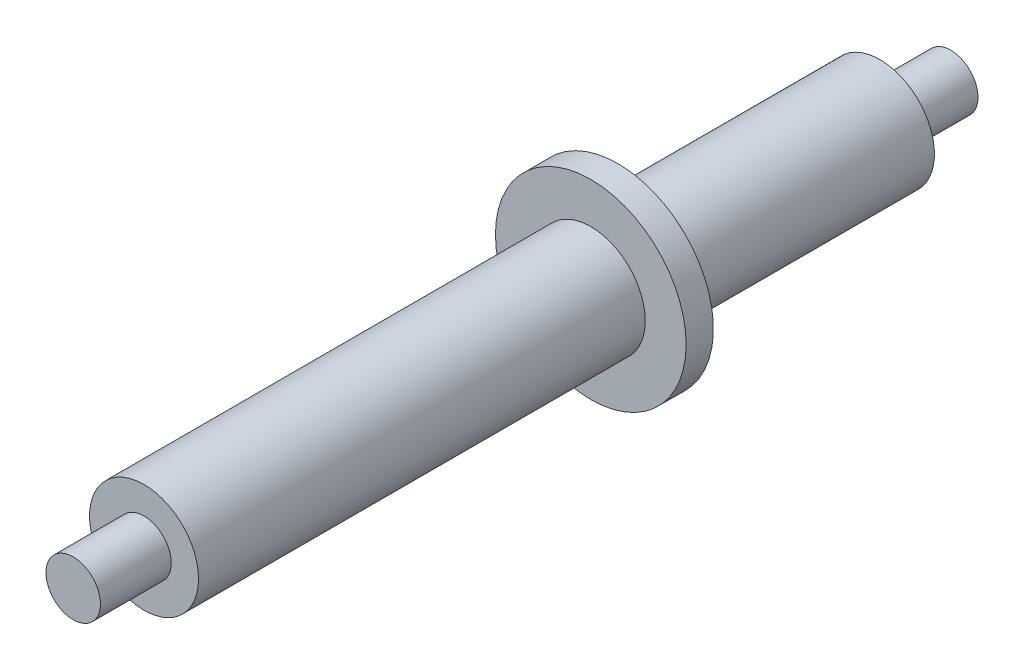
ISO-10303-21;
HEADER;
FILE_DESCRIPTION(('STEP AP214'),'2;1');
FILE_NAME('part.step','',(''),(''),'','','');
FILE_SCHEMA(('AUTOMOTIVE_DESIGN { 1 0 10303 214 1 1 1 1 }'));
ENDSEC;
DATA;
#1=APPLICATION_CONTEXT('core data for automotive mechanical design processes');
#2=APPLICATION_PROTOCOL_DEFINITION('international standard','automotive_design',2000,#1);
#3=PRODUCT_CONTEXT('',#1,'mechanical');
#4=PRODUCT('Part','Part','',(#3));
#5=PRODUCT_RELATED_PRODUCT_CATEGORY('part','',(#4));
#6=PRODUCT_DEFINITION_FORMATION('','',#4);
#7=PRODUCT_DEFINITION_CONTEXT('part definition',#1,'design');
#8=PRODUCT_DEFINITION('design','',#6,#7);
#9=PRODUCT_DEFINITION_SHAPE('','',#8);
#10=(LENGTH_UNIT() NAMED_UNIT(*) SI_UNIT(.MILLI.,.METRE.));
#11=(NAMED_UNIT(*) PLANE_ANGLE_UNIT() SI_UNIT($,.RADIAN.));
#12=(NAMED_UNIT(*) SI_UNIT($,.STERADIAN.) SOLID_ANGLE_UNIT());
#13=UNCERTAINTY_MEASURE_WITH_UNIT(LENGTH_MEASURE(1.E-05),#10,'distance_accuracy_value','');
#14=(GEOMETRIC_REPRESENTATION_CONTEXT(3) GLOBAL_UNCERTAINTY_ASSIGNED_CONTEXT((#13)) GLOBAL_UNIT_ASSIGNED_CONTEXT((#10,
#11,#12)) REPRESENTATION_CONTEXT('',''));
#15=CARTESIAN_POINT('',(0.,0.,0.));
#16=DIRECTION('',(0.,0.,1.));
#17=DIRECTION('',(1.,0.,0.));
#18=AXIS2_PLACEMENT_3D('',#15,#16,#17);
#19=CARTESIAN_POINT('',(0.,0.,36.0568542494954));
#20=DIRECTION('',(0.,0.,-1.));
#21=DIRECTION('',(-1.,0.,0.));
#22=AXIS2_PLACEMENT_3D('',#19,#20,#21);
#23=CYLINDRICAL_SURFACE('',#22,2.);
#24=CARTESIAN_POINT('',(0.,0.,14.000000000003));
#25=DIRECTION('',(0.,0.,1.));
#26=DIRECTION('',(1.,0.,0.));
#27=AXIS2_PLACEMENT_3D('',#24,#25,#26);
#28=CIRCLE('',#27,2.);
#29=CARTESIAN_POINT('',(2.,0.,14.000000000003));
#30=VERTEX_POINT('',#29);
#31=EDGE_CURVE('E10',#30,#30,#28,.F.);
#32=ORIENTED_EDGE('',*,*,#31,.F.);
#33=EDGE_LOOP('',(#32));
#34=FACE_BOUND('',#33,.T.);
#35=CARTESIAN_POINT('',(0.,0.,30.400000000003));
#36=DIRECTION('',(0.,0.,1.));
#37=DIRECTION('',(1.,0.,0.));
#38=AXIS2_PLACEMENT_3D('',#35,#36,#37);
#39=CIRCLE('',#38,2.);
#40=CARTESIAN_POINT('',(2.,0.,30.400000000003));
#41=VERTEX_POINT('',#40);
#42=EDGE_CURVE('E62',#41,#41,#39,.F.);
#43=ORIENTED_EDGE('',*,*,#42,.T.);
#44=EDGE_LOOP('',(#43));
#45=FACE_BOUND('',#44,.T.);
#46=ADVANCED_FACE('F37',(#34,#45),#23,.T.);
#47=CARTESIAN_POINT('',(0.,0.,30.400000000003));
#48=DIRECTION('',(0.,0.,1.));
#49=DIRECTION('',(0.98724149418011,-0.159230123309075,0.));
#50=AXIS2_PLACEMENT_3D('',#47,#48,#49);
#51=PLANE('',#50);
#52=CARTESIAN_POINT('',(0.,0.,30.400000000003));
#53=DIRECTION('',(0.,0.,1.));
#54=DIRECTION('',(1.,0.,0.));
#55=AXIS2_PLACEMENT_3D('',#52,#53,#54);
#56=CIRCLE('',#55,1.);
#57=CARTESIAN_POINT('',(1.,0.,30.400000000003));
#58=VERTEX_POINT('',#57);
#59=EDGE_CURVE('E59',#58,#58,#56,.T.);
#60=ORIENTED_EDGE('',*,*,#59,.F.);
#61=EDGE_LOOP('',(#60));
#62=FACE_BOUND('',#61,.T.);
#63=ORIENTED_EDGE('',*,*,#42,.F.);
#64=EDGE_LOOP('',(#63));
#65=FACE_BOUND('',#64,.T.);
#66=ADVANCED_FACE('F39',(#62,#65),#51,.T.);
#67=CARTESIAN_POINT('',(0.,0.,35.8284271247492));
#68=DIRECTION('',(0.,0.,-1.));
#69=DIRECTION('',(-1.,0.,0.));
#70=AXIS2_PLACEMENT_3D('',#67,#68,#69);
#71=CYLINDRICAL_SURFACE('',#70,1.);
#72=ORIENTED_EDGE('',*,*,#59,.T.);
#73=EDGE_LOOP('',(#72));
#74=FACE_BOUND('',#73,.T.);
#75=CARTESIAN_POINT('',(0.,0.,33.000000000003));
#76=DIRECTION('',(0.,0.,1.));
#77=DIRECTION('',(1.,0.,0.));
#78=AXIS2_PLACEMENT_3D('',#75,#76,#77);
#79=CIRCLE('',#78,1.);
#80=CARTESIAN_POINT('',(1.,0.,33.000000000003));
#81=VERTEX_POINT('',#80);
#82=EDGE_CURVE('E68',#81,#81,#79,.T.);
#83=ORIENTED_EDGE('',*,*,#82,.F.);
#84=EDGE_LOOP('',(#83));
#85=FACE_BOUND('',#84,.T.);
#86=ADVANCED_FACE('F105',(#74,#85),#71,.T.);
#87=CARTESIAN_POINT('',(-40.,-68.9132998221155,33.000000000003));
#88=DIRECTION('',(0.,0.,1.));
#89=DIRECTION('',(1.,0.,0.));
#90=AXIS2_PLACEMENT_3D('',#87,#88,#89);
#91=PLANE('',#90);
#92=ORIENTED_EDGE('',*,*,#82,.T.);
#93=EDGE_LOOP('',(#92));
#94=FACE_BOUND('',#93,.T.);
#95=ADVANCED_FACE('F98',(#94),#91,.T.);
#96=CARTESIAN_POINT('',(0.,0.,14.000000000003));
#97=DIRECTION('',(0.,0.,1.));
#98=DIRECTION('',(-1.00000000000002,0.,0.));
#99=AXIS2_PLACEMENT_3D('',#96,#97,#98);
#100=PLANE('',#99);
#101=ORIENTED_EDGE('',*,*,#31,.T.);
#102=EDGE_LOOP('',(#101));
#103=FACE_BOUND('',#102,.T.);
#104=CARTESIAN_POINT('',(0.,0.,14.000000000003));
#105=DIRECTION('',(0.,0.,1.));
#106=DIRECTION('',(1.,0.,0.));
#107=AXIS2_PLACEMENT_3D('',#104,#105,#106);
#108=CIRCLE('',#107,3.5);
#109=CARTESIAN_POINT('',(3.5,0.,14.000000000003));
#110=VERTEX_POINT('',#109);
#111=EDGE_CURVE('E78',#110,#110,#108,.F.);
#112=ORIENTED_EDGE('',*,*,#111,.F.);
#113=EDGE_LOOP('',(#112));
#114=FACE_BOUND('',#113,.T.);
#115=ADVANCED_FACE('F96',(#103,#114),#100,.T.);
#116=CARTESIAN_POINT('',(0.,0.,13.0000000000028));
#117=DIRECTION('',(0.,0.,-1.00000000000002));
#118=DIRECTION('',(-1.,0.,0.));
#119=AXIS2_PLACEMENT_3D('',#116,#117,#118);
#120=PLANE('',#119);
#121=CARTESIAN_POINT('',(0.,0.,13.0000000000028));
#122=DIRECTION('',(0.,0.,-1.00000000000002));
#123=DIRECTION('',(-1.,0.,0.));
#124=AXIS2_PLACEMENT_3D('',#121,#122,#123);
#125=CIRCLE('',#124,2.);
#126=CARTESIAN_POINT('',(-2.,0.,13.0000000000028));
#127=VERTEX_POINT('',#126);
#128=EDGE_CURVE('E45',#127,#127,#125,.F.);
#129=ORIENTED_EDGE('',*,*,#128,.T.);
#130=EDGE_LOOP('',(#129));
#131=FACE_BOUND('',#130,.T.);
#132=CARTESIAN_POINT('',(0.,0.,13.0000000000028));
#133=DIRECTION('',(0.,0.,-1.00000000000002));
#134=DIRECTION('',(-1.,0.,0.));
#135=AXIS2_PLACEMENT_3D('',#132,#133,#134);
#136=CIRCLE('',#135,3.5);
#137=CARTESIAN_POINT('',(-3.5,0.,13.0000000000028));
#138=VERTEX_POINT('',#137);
#139=EDGE_CURVE('E82',#138,#138,#136,.T.);
#140=ORIENTED_EDGE('',*,*,#139,.T.);
#141=EDGE_LOOP('',(#140));
#142=FACE_BOUND('',#141,.T.);
#143=ADVANCED_FACE('F87',(#131,#142),#120,.T.);
#144=CARTESIAN_POINT('',(0.,0.,23.8994949366147));
#145=DIRECTION('',(0.,0.,-1.));
#146=DIRECTION('',(-1.,0.,0.));
#147=AXIS2_PLACEMENT_3D('',#144,#145,#146);
#148=CYLINDRICAL_SURFACE('',#147,3.5);
#149=ORIENTED_EDGE('',*,*,#139,.F.);
#150=EDGE_LOOP('',(#149));
#151=FACE_BOUND('',#150,.T.);
#152=ORIENTED_EDGE('',*,*,#111,.T.);
#153=EDGE_LOOP('',(#152));
#154=FACE_BOUND('',#153,.T.);
#155=ADVANCED_FACE('F89',(#151,#154),#148,.T.);
#156=CARTESIAN_POINT('',(-40.,-68.9132998221155,0.786462288642813));
#157=DIRECTION('',(0.,0.,1.));
#158=DIRECTION('',(1.,0.,0.));
#159=AXIS2_PLACEMENT_3D('',#156,#157,#158);
#160=PLANE('',#159);
#161=CARTESIAN_POINT('',(0.,0.,0.786462288642813));
#162=DIRECTION('',(0.,0.,1.));
#163=DIRECTION('',(1.,0.,0.));
#164=AXIS2_PLACEMENT_3D('',#161,#162,#163);
#165=CIRCLE('',#164,1.);
#166=CARTESIAN_POINT('',(1.,0.,0.786462288642813));
#167=VERTEX_POINT('',#166);
#168=EDGE_CURVE('E72',#167,#167,#165,.T.);
#169=ORIENTED_EDGE('',*,*,#168,.F.);
#170=EDGE_LOOP('',(#169));
#171=FACE_BOUND('',#170,.T.);
#172=ADVANCED_FACE('F92',(#171),#160,.F.);
#173=CARTESIAN_POINT('',(0.,0.,-2.04196483610338));
#174=DIRECTION('',(0.,0.,1.));
#175=DIRECTION('',(1.,0.,0.));
#176=AXIS2_PLACEMENT_3D('',#173,#174,#175);
#177=CYLINDRICAL_SURFACE('',#176,1.);
#178=ORIENTED_EDGE('',*,*,#168,.T.);
#179=EDGE_LOOP('',(#178));
#180=FACE_BOUND('',#179,.T.);
#181=CARTESIAN_POINT('',(0.,0.,3.38646228864281));
#182=DIRECTION('',(0.,0.,-1.));
#183=DIRECTION('',(-1.,0.,0.));
#184=AXIS2_PLACEMENT_3D('',#181,#182,#183);
#185=CIRCLE('',#184,1.);
#186=CARTESIAN_POINT('',(-1.,0.,3.38646228864281));
#187=VERTEX_POINT('',#186);
#188=EDGE_CURVE('E53',#187,#187,#185,.T.);
#189=ORIENTED_EDGE('',*,*,#188,.T.);
#190=EDGE_LOOP('',(#189));
#191=FACE_BOUND('',#190,.T.);
#192=ADVANCED_FACE('F124',(#180,#191),#177,.T.);
#193=CARTESIAN_POINT('',(0.,0.,3.38646228864281));
#194=DIRECTION('',(0.,0.,-1.));
#195=DIRECTION('',(-1.,0.,0.));
#196=AXIS2_PLACEMENT_3D('',#193,#194,#195);
#197=PLANE('',#196);
#198=ORIENTED_EDGE('',*,*,#188,.F.);
#199=EDGE_LOOP('',(#198));
#200=FACE_BOUND('',#199,.T.);
#201=CARTESIAN_POINT('',(0.,0.,3.38646228864281));
#202=DIRECTION('',(0.,0.,-1.));
#203=DIRECTION('',(-1.,0.,0.));
#204=AXIS2_PLACEMENT_3D('',#201,#202,#203);
#205=CIRCLE('',#204,2.);
#206=CARTESIAN_POINT('',(-2.,0.,3.38646228864281));
#207=VERTEX_POINT('',#206);
#208=EDGE_CURVE('E65',#207,#207,#205,.T.);
#209=ORIENTED_EDGE('',*,*,#208,.T.);
#210=EDGE_LOOP('',(#209));
#211=FACE_BOUND('',#210,.T.);
#212=ADVANCED_FACE('F119',(#200,#211),#197,.T.);
#213=ORIENTED_EDGE('',*,*,#128,.F.);
#214=EDGE_LOOP('',(#213));
#215=FACE_BOUND('',#214,.T.);
#216=ORIENTED_EDGE('',*,*,#208,.F.);
#217=EDGE_LOOP('',(#216));
#218=FACE_BOUND('',#217,.T.);
#219=ADVANCED_FACE('F111',(#215,#218),#23,.T.);
#220=CLOSED_SHELL('',(#46,#66,#86,#95,#115,#143,#155,#172,#192,#212,#219));
#221=MANIFOLD_SOLID_BREP('B2',#220);
#222=ADVANCED_BREP_SHAPE_REPRESENTATION('',(#18,#221),#14);
#223=SHAPE_DEFINITION_REPRESENTATION(#9,#222);
ENDSEC;
END-ISO-10303-21;
